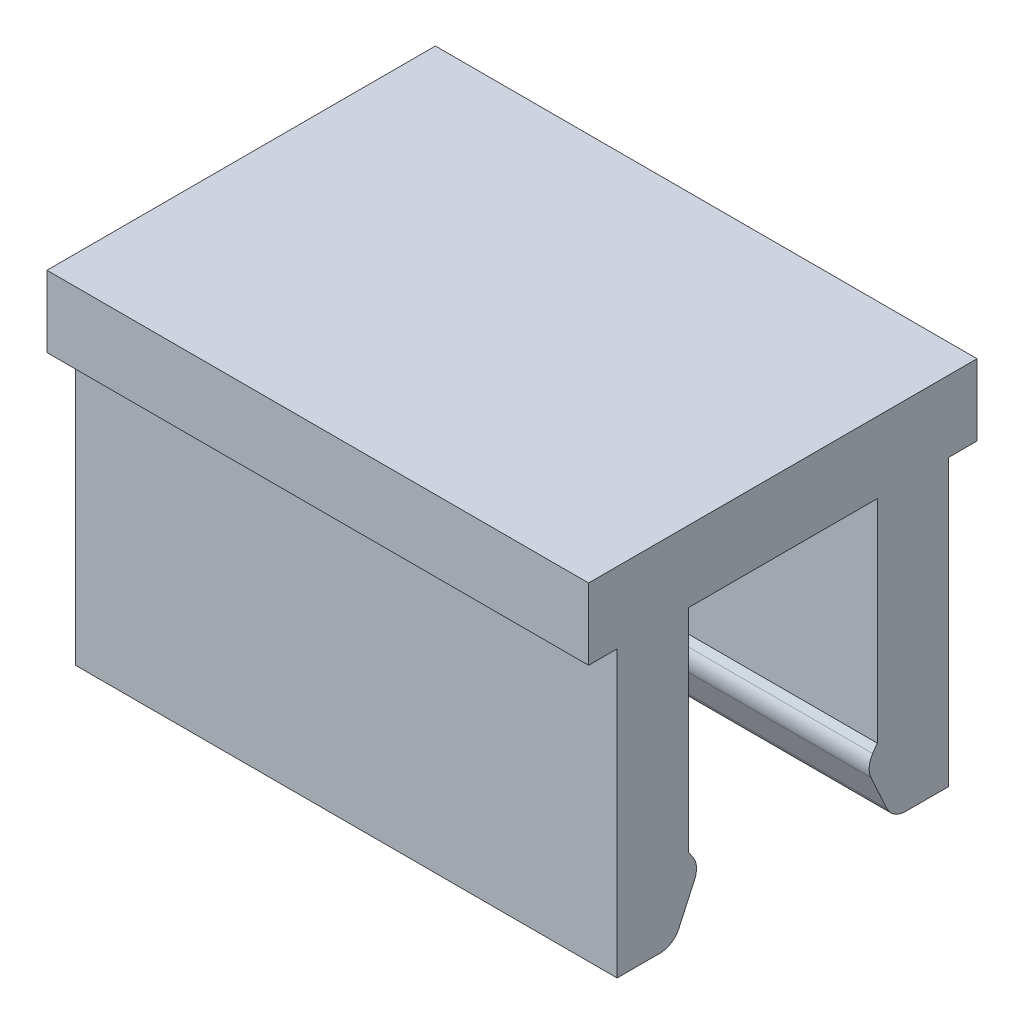
ISO-10303-21;
HEADER;
FILE_DESCRIPTION(('STEP AP214'),'2;1');
FILE_NAME('part.step','',(''),(''),'','','');
FILE_SCHEMA(('AUTOMOTIVE_DESIGN { 1 0 10303 214 1 1 1 1 }'));
ENDSEC;
DATA;
#1=APPLICATION_CONTEXT('core data for automotive mechanical design processes');
#2=APPLICATION_PROTOCOL_DEFINITION('international standard','automotive_design',2000,#1);
#3=PRODUCT_CONTEXT('',#1,'mechanical');
#4=PRODUCT('Part','Part','',(#3));
#5=PRODUCT_RELATED_PRODUCT_CATEGORY('part','',(#4));
#6=PRODUCT_DEFINITION_FORMATION('','',#4);
#7=PRODUCT_DEFINITION_CONTEXT('part definition',#1,'design');
#8=PRODUCT_DEFINITION('design','',#6,#7);
#9=PRODUCT_DEFINITION_SHAPE('','',#8);
#10=(LENGTH_UNIT() NAMED_UNIT(*) SI_UNIT(.MILLI.,.METRE.));
#11=(NAMED_UNIT(*) PLANE_ANGLE_UNIT() SI_UNIT($,.RADIAN.));
#12=(NAMED_UNIT(*) SI_UNIT($,.STERADIAN.) SOLID_ANGLE_UNIT());
#13=UNCERTAINTY_MEASURE_WITH_UNIT(LENGTH_MEASURE(1.E-05),#10,'distance_accuracy_value','');
#14=(GEOMETRIC_REPRESENTATION_CONTEXT(3) GLOBAL_UNCERTAINTY_ASSIGNED_CONTEXT((#13)) GLOBAL_UNIT_ASSIGNED_CONTEXT((#10,
#11,#12)) REPRESENTATION_CONTEXT('',''));
#15=CARTESIAN_POINT('',(0.,0.,0.));
#16=DIRECTION('',(0.,0.,1.));
#17=DIRECTION('',(1.,0.,0.));
#18=AXIS2_PLACEMENT_3D('',#15,#16,#17);
#19=CARTESIAN_POINT('',(-3.8,1.42287130399886,1.50001192514399));
#20=DIRECTION('',(-1.,0.,0.));
#21=DIRECTION('',(0.,1.,0.));
#22=AXIS2_PLACEMENT_3D('',#19,#20,#21);
#23=PLANE('',#22);
#24=DIRECTION('',(0.,1.,0.));
#25=VECTOR('',#24,1.);
#26=CARTESIAN_POINT('',(-3.8,4.65,1.325));
#27=LINE('',#26,#25);
#28=CARTESIAN_POINT('',(-3.8,1.67931591606146,1.325));
#29=VERTEX_POINT('',#28);
#30=CARTESIAN_POINT('',(-3.8,4.65,1.325));
#31=VERTEX_POINT('',#30);
#32=EDGE_CURVE('E297',#29,#31,#27,.T.);
#33=ORIENTED_EDGE('',*,*,#32,.F.);
#34=DIRECTION('',(0.,0.827029873452824,0.5621579746091));
#35=VECTOR('',#34,1.);
#36=CARTESIAN_POINT('',(-3.8,1.58528013365411,1.26108094861411));
#37=LINE('',#36,#35);
#38=CARTESIAN_POINT('',(-3.8,1.58528013365411,1.26108094861411));
#39=VERTEX_POINT('',#38);
#40=EDGE_CURVE('E27',#39,#29,#37,.T.);
#41=ORIENTED_EDGE('',*,*,#40,.F.);
#42=CARTESIAN_POINT('',(-3.8,1.42287130399886,1.50001192514399));
#43=DIRECTION('',(1.,0.,0.));
#44=DIRECTION('',(0.,0.,1.));
#45=AXIS2_PLACEMENT_3D('',#42,#43,#44);
#46=CIRCLE('',#45,0.288902474021096);
#47=CARTESIAN_POINT('',(-3.8,1.3026922137122,1.23729225371952));
#48=VERTEX_POINT('',#47);
#49=EDGE_CURVE('E276',#48,#39,#46,.T.);
#50=ORIENTED_EDGE('',*,*,#49,.F.);
#51=DIRECTION('',(0.,0.909371483628371,-0.415984981415838));
#52=VECTOR('',#51,1.);
#53=CARTESIAN_POINT('',(-3.8,0.818723383734443,1.45868006757625));
#54=LINE('',#53,#52);
#55=CARTESIAN_POINT('',(-3.8,0.818723383734443,1.45868006757625));
#56=VERTEX_POINT('',#55);
#57=EDGE_CURVE('E330',#56,#48,#54,.T.);
#58=ORIENTED_EDGE('',*,*,#57,.F.);
#59=CARTESIAN_POINT('',(-3.8,0.938902474021097,1.72139973900072));
#60=DIRECTION('',(1.,0.,0.));
#61=DIRECTION('',(0.,0.,1.));
#62=AXIS2_PLACEMENT_3D('',#59,#60,#61);
#63=CIRCLE('',#62,0.288902474021096);
#64=CARTESIAN_POINT('',(-3.8,0.65,1.72139973900072));
#65=VERTEX_POINT('',#64);
#66=EDGE_CURVE('E241',#65,#56,#63,.T.);
#67=ORIENTED_EDGE('',*,*,#66,.F.);
#68=DIRECTION('',(0.,0.,-1.));
#69=VECTOR('',#68,1.);
#70=CARTESIAN_POINT('',(-3.8,0.65,1.72139973900072));
#71=LINE('',#70,#69);
#72=CARTESIAN_POINT('',(-3.8,0.65,2.325));
#73=VERTEX_POINT('',#72);
#74=EDGE_CURVE('E237',#73,#65,#71,.T.);
#75=ORIENTED_EDGE('',*,*,#74,.F.);
#76=DIRECTION('',(0.,-1.,0.));
#77=VECTOR('',#76,1.);
#78=CARTESIAN_POINT('',(-3.8,0.65,2.325));
#79=LINE('',#78,#77);
#80=CARTESIAN_POINT('',(-3.8,4.65,2.325));
#81=VERTEX_POINT('',#80);
#82=EDGE_CURVE('E87',#81,#73,#79,.T.);
#83=ORIENTED_EDGE('',*,*,#82,.F.);
#84=DIRECTION('',(0.,0.,-1.));
#85=VECTOR('',#84,1.);
#86=CARTESIAN_POINT('',(-3.8,4.65,2.325));
#87=LINE('',#86,#85);
#88=CARTESIAN_POINT('',(-3.8,4.65,2.725));
#89=VERTEX_POINT('',#88);
#90=EDGE_CURVE('E344',#89,#81,#87,.T.);
#91=ORIENTED_EDGE('',*,*,#90,.F.);
#92=DIRECTION('',(0.,-1.,0.));
#93=VECTOR('',#92,1.);
#94=CARTESIAN_POINT('',(-3.8,4.65,2.725));
#95=LINE('',#94,#93);
#96=CARTESIAN_POINT('',(-3.8,5.65,2.725));
#97=VERTEX_POINT('',#96);
#98=EDGE_CURVE('E308',#97,#89,#95,.T.);
#99=ORIENTED_EDGE('',*,*,#98,.F.);
#100=DIRECTION('',(0.,0.,1.));
#101=VECTOR('',#100,1.);
#102=CARTESIAN_POINT('',(-3.8,5.65,2.725));
#103=LINE('',#102,#101);
#104=CARTESIAN_POINT('',(-3.8,5.65,-2.725));
#105=VERTEX_POINT('',#104);
#106=EDGE_CURVE('E402',#105,#97,#103,.T.);
#107=ORIENTED_EDGE('',*,*,#106,.F.);
#108=DIRECTION('',(0.,1.,0.));
#109=VECTOR('',#108,1.);
#110=CARTESIAN_POINT('',(-3.8,4.65,-2.725));
#111=LINE('',#110,#109);
#112=CARTESIAN_POINT('',(-3.8,4.65,-2.725));
#113=VERTEX_POINT('',#112);
#114=EDGE_CURVE('E207',#113,#105,#111,.T.);
#115=ORIENTED_EDGE('',*,*,#114,.F.);
#116=DIRECTION('',(0.,0.,-1.));
#117=VECTOR('',#116,1.);
#118=CARTESIAN_POINT('',(-3.8,4.65,-2.325));
#119=LINE('',#118,#117);
#120=CARTESIAN_POINT('',(-3.8,4.65,-2.325));
#121=VERTEX_POINT('',#120);
#122=EDGE_CURVE('E292',#121,#113,#119,.T.);
#123=ORIENTED_EDGE('',*,*,#122,.F.);
#124=DIRECTION('',(0.,1.,0.));
#125=VECTOR('',#124,1.);
#126=CARTESIAN_POINT('',(-3.8,0.65,-2.325));
#127=LINE('',#126,#125);
#128=CARTESIAN_POINT('',(-3.8,0.65,-2.325));
#129=VERTEX_POINT('',#128);
#130=EDGE_CURVE('E281',#129,#121,#127,.T.);
#131=ORIENTED_EDGE('',*,*,#130,.F.);
#132=DIRECTION('',(0.,0.,-1.));
#133=VECTOR('',#132,1.);
#134=CARTESIAN_POINT('',(-3.8,0.65,-1.72139973900072));
#135=LINE('',#134,#133);
#136=CARTESIAN_POINT('',(-3.8,0.65,-1.72139973900072));
#137=VERTEX_POINT('',#136);
#138=EDGE_CURVE('E299',#137,#129,#135,.T.);
#139=ORIENTED_EDGE('',*,*,#138,.F.);
#140=CARTESIAN_POINT('',(-3.8,0.938902474021097,-1.72139973900072));
#141=DIRECTION('',(1.,0.,0.));
#142=DIRECTION('',(0.,0.,-1.));
#143=AXIS2_PLACEMENT_3D('',#140,#141,#142);
#144=CIRCLE('',#143,0.288902474021096);
#145=CARTESIAN_POINT('',(-3.8,0.818723383734443,-1.45868006757625));
#146=VERTEX_POINT('',#145);
#147=EDGE_CURVE('E368',#146,#137,#144,.T.);
#148=ORIENTED_EDGE('',*,*,#147,.F.);
#149=DIRECTION('',(0.,-0.909371483628371,-0.415984981415838));
#150=VECTOR('',#149,1.);
#151=CARTESIAN_POINT('',(-3.8,0.818723383734443,-1.45868006757625));
#152=LINE('',#151,#150);
#153=CARTESIAN_POINT('',(-3.8,1.3026922137122,-1.23729225371951));
#154=VERTEX_POINT('',#153);
#155=EDGE_CURVE('E335',#154,#146,#152,.T.);
#156=ORIENTED_EDGE('',*,*,#155,.F.);
#157=CARTESIAN_POINT('',(-3.8,1.42287130399886,-1.50001192514399));
#158=DIRECTION('',(1.,0.,0.));
#159=DIRECTION('',(0.,0.,-1.));
#160=AXIS2_PLACEMENT_3D('',#157,#158,#159);
#161=CIRCLE('',#160,0.288902474021096);
#162=CARTESIAN_POINT('',(-3.8,1.58528013365411,-1.26108094861411));
#163=VERTEX_POINT('',#162);
#164=EDGE_CURVE('E298',#163,#154,#161,.T.);
#165=ORIENTED_EDGE('',*,*,#164,.F.);
#166=DIRECTION('',(0.,-0.827029873452824,0.5621579746091));
#167=VECTOR('',#166,1.);
#168=CARTESIAN_POINT('',(-3.8,1.58528013365411,-1.26108094861411));
#169=LINE('',#168,#167);
#170=CARTESIAN_POINT('',(-3.8,1.67931591606146,-1.325));
#171=VERTEX_POINT('',#170);
#172=EDGE_CURVE('E130',#171,#163,#169,.T.);
#173=ORIENTED_EDGE('',*,*,#172,.F.);
#174=DIRECTION('',(0.,-1.,0.));
#175=VECTOR('',#174,1.);
#176=CARTESIAN_POINT('',(-3.8,4.65,-1.325));
#177=LINE('',#176,#175);
#178=CARTESIAN_POINT('',(-3.8,4.65,-1.325));
#179=VERTEX_POINT('',#178);
#180=EDGE_CURVE('E424',#179,#171,#177,.T.);
#181=ORIENTED_EDGE('',*,*,#180,.F.);
#182=DIRECTION('',(0.,0.,-1.));
#183=VECTOR('',#182,1.);
#184=CARTESIAN_POINT('',(-3.8,4.65,-1.325));
#185=LINE('',#184,#183);
#186=EDGE_CURVE('E287',#31,#179,#185,.T.);
#187=ORIENTED_EDGE('',*,*,#186,.F.);
#188=EDGE_LOOP('',(#33,#41,#50,#58,#67,#75,#83,#91,#99,#107,#115,#123,#131,#139,#148,#156,#165,
#173,#181,#187));
#189=FACE_BOUND('',#188,.T.);
#190=ADVANCED_FACE('F16',(#189),#23,.T.);
#191=CARTESIAN_POINT('',(3.8,1.42287130399886,1.50001192514399));
#192=DIRECTION('',(-1.,0.,0.));
#193=DIRECTION('',(0.,1.,0.));
#194=AXIS2_PLACEMENT_3D('',#191,#192,#193);
#195=PLANE('',#194);
#196=DIRECTION('',(0.,1.,0.));
#197=VECTOR('',#196,1.);
#198=CARTESIAN_POINT('',(3.8,4.65,1.325));
#199=LINE('',#198,#197);
#200=CARTESIAN_POINT('',(3.8,1.67931591606146,1.325));
#201=VERTEX_POINT('',#200);
#202=CARTESIAN_POINT('',(3.8,4.65,1.325));
#203=VERTEX_POINT('',#202);
#204=EDGE_CURVE('E288',#201,#203,#199,.T.);
#205=ORIENTED_EDGE('',*,*,#204,.T.);
#206=DIRECTION('',(0.,0.,-1.));
#207=VECTOR('',#206,1.);
#208=CARTESIAN_POINT('',(3.8,4.65,-1.325));
#209=LINE('',#208,#207);
#210=CARTESIAN_POINT('',(3.8,4.65,-1.325));
#211=VERTEX_POINT('',#210);
#212=EDGE_CURVE('E421',#203,#211,#209,.T.);
#213=ORIENTED_EDGE('',*,*,#212,.T.);
#214=DIRECTION('',(0.,-1.,0.));
#215=VECTOR('',#214,1.);
#216=CARTESIAN_POINT('',(3.8,4.65,-1.325));
#217=LINE('',#216,#215);
#218=CARTESIAN_POINT('',(3.8,1.67931591606146,-1.325));
#219=VERTEX_POINT('',#218);
#220=EDGE_CURVE('E147',#211,#219,#217,.T.);
#221=ORIENTED_EDGE('',*,*,#220,.T.);
#222=DIRECTION('',(0.,-0.827029873452824,0.5621579746091));
#223=VECTOR('',#222,1.);
#224=CARTESIAN_POINT('',(3.8,1.58528013365411,-1.26108094861411));
#225=LINE('',#224,#223);
#226=CARTESIAN_POINT('',(3.8,1.58528013365411,-1.26108094861411));
#227=VERTEX_POINT('',#226);
#228=EDGE_CURVE('E340',#219,#227,#225,.T.);
#229=ORIENTED_EDGE('',*,*,#228,.T.);
#230=CARTESIAN_POINT('',(3.8,1.42287130399886,-1.50001192514399));
#231=DIRECTION('',(1.,0.,0.));
#232=DIRECTION('',(0.,0.,-1.));
#233=AXIS2_PLACEMENT_3D('',#230,#231,#232);
#234=CIRCLE('',#233,0.288902474021096);
#235=CARTESIAN_POINT('',(3.8,1.3026922137122,-1.23729225371952));
#236=VERTEX_POINT('',#235);
#237=EDGE_CURVE('E373',#227,#236,#234,.T.);
#238=ORIENTED_EDGE('',*,*,#237,.T.);
#239=DIRECTION('',(0.,-0.909371483628371,-0.415984981415838));
#240=VECTOR('',#239,1.);
#241=CARTESIAN_POINT('',(3.8,0.818723383734443,-1.45868006757625));
#242=LINE('',#241,#240);
#243=CARTESIAN_POINT('',(3.8,0.818723383734443,-1.45868006757625));
#244=VERTEX_POINT('',#243);
#245=EDGE_CURVE('E358',#236,#244,#242,.T.);
#246=ORIENTED_EDGE('',*,*,#245,.T.);
#247=CARTESIAN_POINT('',(3.8,0.938902474021097,-1.72139973900072));
#248=DIRECTION('',(1.,0.,0.));
#249=DIRECTION('',(0.,0.,-1.));
#250=AXIS2_PLACEMENT_3D('',#247,#248,#249);
#251=CIRCLE('',#250,0.288902474021096);
#252=CARTESIAN_POINT('',(3.8,0.65,-1.72139973900072));
#253=VERTEX_POINT('',#252);
#254=EDGE_CURVE('E303',#244,#253,#251,.T.);
#255=ORIENTED_EDGE('',*,*,#254,.T.);
#256=DIRECTION('',(0.,0.,-1.));
#257=VECTOR('',#256,1.);
#258=CARTESIAN_POINT('',(3.8,0.65,-1.72139973900072));
#259=LINE('',#258,#257);
#260=CARTESIAN_POINT('',(3.8,0.65,-2.325));
#261=VERTEX_POINT('',#260);
#262=EDGE_CURVE('E277',#253,#261,#259,.T.);
#263=ORIENTED_EDGE('',*,*,#262,.T.);
#264=DIRECTION('',(0.,1.,0.));
#265=VECTOR('',#264,1.);
#266=CARTESIAN_POINT('',(3.8,0.65,-2.325));
#267=LINE('',#266,#265);
#268=CARTESIAN_POINT('',(3.8,4.65,-2.325));
#269=VERTEX_POINT('',#268);
#270=EDGE_CURVE('E385',#261,#269,#267,.T.);
#271=ORIENTED_EDGE('',*,*,#270,.T.);
#272=DIRECTION('',(0.,0.,-1.));
#273=VECTOR('',#272,1.);
#274=CARTESIAN_POINT('',(3.8,4.65,-2.325));
#275=LINE('',#274,#273);
#276=CARTESIAN_POINT('',(3.8,4.65,-2.725));
#277=VERTEX_POINT('',#276);
#278=EDGE_CURVE('E218',#269,#277,#275,.T.);
#279=ORIENTED_EDGE('',*,*,#278,.T.);
#280=DIRECTION('',(0.,1.,0.));
#281=VECTOR('',#280,1.);
#282=CARTESIAN_POINT('',(3.8,4.65,-2.725));
#283=LINE('',#282,#281);
#284=CARTESIAN_POINT('',(3.8,5.65,-2.725));
#285=VERTEX_POINT('',#284);
#286=EDGE_CURVE('E201',#277,#285,#283,.T.);
#287=ORIENTED_EDGE('',*,*,#286,.T.);
#288=DIRECTION('',(0.,0.,1.));
#289=VECTOR('',#288,1.);
#290=CARTESIAN_POINT('',(3.8,5.65,2.725));
#291=LINE('',#290,#289);
#292=CARTESIAN_POINT('',(3.8,5.65,2.725));
#293=VERTEX_POINT('',#292);
#294=EDGE_CURVE('E386',#285,#293,#291,.T.);
#295=ORIENTED_EDGE('',*,*,#294,.T.);
#296=DIRECTION('',(0.,-1.,0.));
#297=VECTOR('',#296,1.);
#298=CARTESIAN_POINT('',(3.8,4.65,2.725));
#299=LINE('',#298,#297);
#300=CARTESIAN_POINT('',(3.8,4.65,2.725));
#301=VERTEX_POINT('',#300);
#302=EDGE_CURVE('E307',#293,#301,#299,.T.);
#303=ORIENTED_EDGE('',*,*,#302,.T.);
#304=DIRECTION('',(0.,0.,-1.));
#305=VECTOR('',#304,1.);
#306=CARTESIAN_POINT('',(3.8,4.65,2.325));
#307=LINE('',#306,#305);
#308=CARTESIAN_POINT('',(3.8,4.65,2.325));
#309=VERTEX_POINT('',#308);
#310=EDGE_CURVE('E105',#301,#309,#307,.T.);
#311=ORIENTED_EDGE('',*,*,#310,.T.);
#312=DIRECTION('',(0.,-1.,0.));
#313=VECTOR('',#312,1.);
#314=CARTESIAN_POINT('',(3.8,0.65,2.325));
#315=LINE('',#314,#313);
#316=CARTESIAN_POINT('',(3.8,0.65,2.325));
#317=VERTEX_POINT('',#316);
#318=EDGE_CURVE('E247',#309,#317,#315,.T.);
#319=ORIENTED_EDGE('',*,*,#318,.T.);
#320=DIRECTION('',(0.,0.,-1.));
#321=VECTOR('',#320,1.);
#322=CARTESIAN_POINT('',(3.8,0.65,1.72139973900072));
#323=LINE('',#322,#321);
#324=CARTESIAN_POINT('',(3.8,0.65,1.72139973900072));
#325=VERTEX_POINT('',#324);
#326=EDGE_CURVE('E252',#317,#325,#323,.T.);
#327=ORIENTED_EDGE('',*,*,#326,.T.);
#328=CARTESIAN_POINT('',(3.8,0.938902474021097,1.72139973900072));
#329=DIRECTION('',(1.,0.,0.));
#330=DIRECTION('',(0.,0.,1.));
#331=AXIS2_PLACEMENT_3D('',#328,#329,#330);
#332=CIRCLE('',#331,0.288902474021096);
#333=CARTESIAN_POINT('',(3.8,0.818723383734443,1.45868006757625));
#334=VERTEX_POINT('',#333);
#335=EDGE_CURVE('E326',#325,#334,#332,.T.);
#336=ORIENTED_EDGE('',*,*,#335,.T.);
#337=DIRECTION('',(0.,0.909371483628371,-0.415984981415838));
#338=VECTOR('',#337,1.);
#339=CARTESIAN_POINT('',(3.8,0.818723383734443,1.45868006757625));
#340=LINE('',#339,#338);
#341=CARTESIAN_POINT('',(3.8,1.3026922137122,1.23729225371951));
#342=VERTEX_POINT('',#341);
#343=EDGE_CURVE('E369',#334,#342,#340,.T.);
#344=ORIENTED_EDGE('',*,*,#343,.T.);
#345=CARTESIAN_POINT('',(3.8,1.42287130399886,1.50001192514399));
#346=DIRECTION('',(1.,0.,0.));
#347=DIRECTION('',(0.,0.,1.));
#348=AXIS2_PLACEMENT_3D('',#345,#346,#347);
#349=CIRCLE('',#348,0.288902474021096);
#350=CARTESIAN_POINT('',(3.8,1.58528013365411,1.26108094861411));
#351=VERTEX_POINT('',#350);
#352=EDGE_CURVE('E272',#342,#351,#349,.T.);
#353=ORIENTED_EDGE('',*,*,#352,.T.);
#354=DIRECTION('',(0.,0.827029873452824,0.5621579746091));
#355=VECTOR('',#354,1.);
#356=CARTESIAN_POINT('',(3.8,1.58528013365411,1.26108094861411));
#357=LINE('',#356,#355);
#358=EDGE_CURVE('E11',#351,#201,#357,.T.);
#359=ORIENTED_EDGE('',*,*,#358,.T.);
#360=EDGE_LOOP('',(#205,#213,#221,#229,#238,#246,#255,#263,#271,#279,#287,#295,#303,#311,#319,
#327,#336,#344,#353,#359));
#361=FACE_BOUND('',#360,.T.);
#362=ADVANCED_FACE('F470',(#361),#195,.F.);
#363=CARTESIAN_POINT('',(3.8,1.58528013365411,1.26108094861411));
#364=DIRECTION('',(0.,-0.5621579746091,0.827029873452824));
#365=DIRECTION('',(-1.,0.,0.));
#366=AXIS2_PLACEMENT_3D('',#363,#364,#365);
#367=PLANE('',#366);
#368=ORIENTED_EDGE('',*,*,#40,.T.);
#369=DIRECTION('',(-1.,0.,0.));
#370=VECTOR('',#369,1.);
#371=CARTESIAN_POINT('',(3.8,1.67931591606146,1.325));
#372=LINE('',#371,#370);
#373=EDGE_CURVE('E283',#201,#29,#372,.T.);
#374=ORIENTED_EDGE('',*,*,#373,.F.);
#375=ORIENTED_EDGE('',*,*,#358,.F.);
#376=DIRECTION('',(-1.,0.,0.));
#377=VECTOR('',#376,1.);
#378=CARTESIAN_POINT('',(3.8,1.58528013365411,1.26108094861411));
#379=LINE('',#378,#377);
#380=EDGE_CURVE('E273',#351,#39,#379,.T.);
#381=ORIENTED_EDGE('',*,*,#380,.T.);
#382=EDGE_LOOP('',(#368,#374,#375,#381));
#383=FACE_BOUND('',#382,.T.);
#384=ADVANCED_FACE('F468',(#383),#367,.F.);
#385=CARTESIAN_POINT('',(3.8,1.42287130399886,1.50001192514399));
#386=DIRECTION('',(-1.,0.,0.));
#387=DIRECTION('',(0.,0.,1.));
#388=AXIS2_PLACEMENT_3D('',#385,#386,#387);
#389=CYLINDRICAL_SURFACE('',#388,0.288902474021096);
#390=ORIENTED_EDGE('',*,*,#49,.T.);
#391=ORIENTED_EDGE('',*,*,#380,.F.);
#392=ORIENTED_EDGE('',*,*,#352,.F.);
#393=DIRECTION('',(-1.,0.,0.));
#394=VECTOR('',#393,1.);
#395=CARTESIAN_POINT('',(3.8,1.3026922137122,1.23729225371951));
#396=LINE('',#395,#394);
#397=EDGE_CURVE('E350',#342,#48,#396,.T.);
#398=ORIENTED_EDGE('',*,*,#397,.T.);
#399=EDGE_LOOP('',(#390,#391,#392,#398));
#400=FACE_BOUND('',#399,.T.);
#401=ADVANCED_FACE('F463',(#400),#389,.T.);
#402=CARTESIAN_POINT('',(3.8,0.818723383734443,1.45868006757625));
#403=DIRECTION('',(0.,0.415984981415838,0.909371483628371));
#404=DIRECTION('',(1.,0.,0.));
#405=AXIS2_PLACEMENT_3D('',#402,#403,#404);
#406=PLANE('',#405);
#407=ORIENTED_EDGE('',*,*,#57,.T.);
#408=ORIENTED_EDGE('',*,*,#397,.F.);
#409=ORIENTED_EDGE('',*,*,#343,.F.);
#410=DIRECTION('',(-1.,0.,0.));
#411=VECTOR('',#410,1.);
#412=CARTESIAN_POINT('',(3.8,0.818723383734443,1.45868006757625));
#413=LINE('',#412,#411);
#414=EDGE_CURVE('E325',#334,#56,#413,.T.);
#415=ORIENTED_EDGE('',*,*,#414,.T.);
#416=EDGE_LOOP('',(#407,#408,#409,#415));
#417=FACE_BOUND('',#416,.T.);
#418=ADVANCED_FACE('F466',(#417),#406,.F.);
#419=CARTESIAN_POINT('',(3.8,0.938902474021097,1.72139973900072));
#420=DIRECTION('',(-1.,0.,0.));
#421=DIRECTION('',(0.,0.,1.));
#422=AXIS2_PLACEMENT_3D('',#419,#420,#421);
#423=CYLINDRICAL_SURFACE('',#422,0.288902474021096);
#424=ORIENTED_EDGE('',*,*,#66,.T.);
#425=ORIENTED_EDGE('',*,*,#414,.F.);
#426=ORIENTED_EDGE('',*,*,#335,.F.);
#427=DIRECTION('',(-1.,0.,0.));
#428=VECTOR('',#427,1.);
#429=CARTESIAN_POINT('',(3.8,0.65,1.72139973900072));
#430=LINE('',#429,#428);
#431=EDGE_CURVE('E246',#325,#65,#430,.T.);
#432=ORIENTED_EDGE('',*,*,#431,.T.);
#433=EDGE_LOOP('',(#424,#425,#426,#432));
#434=FACE_BOUND('',#433,.T.);
#435=ADVANCED_FACE('F601',(#434),#423,.T.);
#436=CARTESIAN_POINT('',(3.8,0.65,1.72139973900072));
#437=DIRECTION('',(0.,1.,0.));
#438=DIRECTION('',(1.,0.,0.));
#439=AXIS2_PLACEMENT_3D('',#436,#437,#438);
#440=PLANE('',#439);
#441=ORIENTED_EDGE('',*,*,#74,.T.);
#442=ORIENTED_EDGE('',*,*,#431,.F.);
#443=ORIENTED_EDGE('',*,*,#326,.F.);
#444=DIRECTION('',(-1.,0.,0.));
#445=VECTOR('',#444,1.);
#446=CARTESIAN_POINT('',(3.8,0.65,2.325));
#447=LINE('',#446,#445);
#448=EDGE_CURVE('E20',#317,#73,#447,.T.);
#449=ORIENTED_EDGE('',*,*,#448,.T.);
#450=EDGE_LOOP('',(#441,#442,#443,#449));
#451=FACE_BOUND('',#450,.T.);
#452=ADVANCED_FACE('F250',(#451),#440,.F.);
#453=CARTESIAN_POINT('',(3.8,0.65,2.325));
#454=DIRECTION('',(0.,0.,-1.));
#455=DIRECTION('',(-1.,0.,0.));
#456=AXIS2_PLACEMENT_3D('',#453,#454,#455);
#457=PLANE('',#456);
#458=ORIENTED_EDGE('',*,*,#82,.T.);
#459=ORIENTED_EDGE('',*,*,#448,.F.);
#460=ORIENTED_EDGE('',*,*,#318,.F.);
#461=DIRECTION('',(-1.,0.,0.));
#462=VECTOR('',#461,1.);
#463=CARTESIAN_POINT('',(3.8,4.65,2.325));
#464=LINE('',#463,#462);
#465=EDGE_CURVE('E257',#309,#81,#464,.T.);
#466=ORIENTED_EDGE('',*,*,#465,.T.);
#467=EDGE_LOOP('',(#458,#459,#460,#466));
#468=FACE_BOUND('',#467,.T.);
#469=ADVANCED_FACE('F256',(#468),#457,.F.);
#470=CARTESIAN_POINT('',(3.8,4.65,2.325));
#471=DIRECTION('',(0.,1.,0.));
#472=DIRECTION('',(1.,0.,0.));
#473=AXIS2_PLACEMENT_3D('',#470,#471,#472);
#474=PLANE('',#473);
#475=ORIENTED_EDGE('',*,*,#90,.T.);
#476=ORIENTED_EDGE('',*,*,#465,.F.);
#477=ORIENTED_EDGE('',*,*,#310,.F.);
#478=DIRECTION('',(-1.,0.,0.));
#479=VECTOR('',#478,1.);
#480=CARTESIAN_POINT('',(3.8,4.65,2.725));
#481=LINE('',#480,#479);
#482=EDGE_CURVE('E304',#301,#89,#481,.T.);
#483=ORIENTED_EDGE('',*,*,#482,.T.);
#484=EDGE_LOOP('',(#475,#476,#477,#483));
#485=FACE_BOUND('',#484,.T.);
#486=ADVANCED_FACE('F661',(#485),#474,.F.);
#487=CARTESIAN_POINT('',(3.8,4.65,2.725));
#488=DIRECTION('',(0.,0.,-1.));
#489=DIRECTION('',(-1.,0.,0.));
#490=AXIS2_PLACEMENT_3D('',#487,#488,#489);
#491=PLANE('',#490);
#492=ORIENTED_EDGE('',*,*,#98,.T.);
#493=ORIENTED_EDGE('',*,*,#482,.F.);
#494=ORIENTED_EDGE('',*,*,#302,.F.);
#495=DIRECTION('',(-1.,0.,0.));
#496=VECTOR('',#495,1.);
#497=CARTESIAN_POINT('',(3.8,5.65,2.725));
#498=LINE('',#497,#496);
#499=EDGE_CURVE('E390',#293,#97,#498,.T.);
#500=ORIENTED_EDGE('',*,*,#499,.T.);
#501=EDGE_LOOP('',(#492,#493,#494,#500));
#502=FACE_BOUND('',#501,.T.);
#503=ADVANCED_FACE('F497',(#502),#491,.F.);
#504=CARTESIAN_POINT('',(3.8,5.65,2.725));
#505=DIRECTION('',(0.,-1.,0.));
#506=DIRECTION('',(0.,0.,-1.));
#507=AXIS2_PLACEMENT_3D('',#504,#505,#506);
#508=PLANE('',#507);
#509=ORIENTED_EDGE('',*,*,#106,.T.);
#510=ORIENTED_EDGE('',*,*,#499,.F.);
#511=ORIENTED_EDGE('',*,*,#294,.F.);
#512=DIRECTION('',(-1.,0.,0.));
#513=VECTOR('',#512,1.);
#514=CARTESIAN_POINT('',(3.8,5.65,-2.725));
#515=LINE('',#514,#513);
#516=EDGE_CURVE('E319',#285,#105,#515,.T.);
#517=ORIENTED_EDGE('',*,*,#516,.T.);
#518=EDGE_LOOP('',(#509,#510,#511,#517));
#519=FACE_BOUND('',#518,.T.);
#520=ADVANCED_FACE('F495',(#519),#508,.F.);
#521=CARTESIAN_POINT('',(3.8,4.65,-2.725));
#522=DIRECTION('',(0.,0.,1.));
#523=DIRECTION('',(1.,0.,0.));
#524=AXIS2_PLACEMENT_3D('',#521,#522,#523);
#525=PLANE('',#524);
#526=ORIENTED_EDGE('',*,*,#114,.T.);
#527=ORIENTED_EDGE('',*,*,#516,.F.);
#528=ORIENTED_EDGE('',*,*,#286,.F.);
#529=DIRECTION('',(-1.,0.,0.));
#530=VECTOR('',#529,1.);
#531=CARTESIAN_POINT('',(3.8,4.65,-2.725));
#532=LINE('',#531,#530);
#533=EDGE_CURVE('E289',#277,#113,#532,.T.);
#534=ORIENTED_EDGE('',*,*,#533,.T.);
#535=EDGE_LOOP('',(#526,#527,#528,#534));
#536=FACE_BOUND('',#535,.T.);
#537=ADVANCED_FACE('F486',(#536),#525,.F.);
#538=CARTESIAN_POINT('',(3.8,4.65,-2.325));
#539=DIRECTION('',(0.,1.,0.));
#540=DIRECTION('',(1.,0.,0.));
#541=AXIS2_PLACEMENT_3D('',#538,#539,#540);
#542=PLANE('',#541);
#543=ORIENTED_EDGE('',*,*,#122,.T.);
#544=ORIENTED_EDGE('',*,*,#533,.F.);
#545=ORIENTED_EDGE('',*,*,#278,.F.);
#546=DIRECTION('',(-1.,0.,0.));
#547=VECTOR('',#546,1.);
#548=CARTESIAN_POINT('',(3.8,4.65,-2.325));
#549=LINE('',#548,#547);
#550=EDGE_CURVE('E420',#269,#121,#549,.T.);
#551=ORIENTED_EDGE('',*,*,#550,.T.);
#552=EDGE_LOOP('',(#543,#544,#545,#551));
#553=FACE_BOUND('',#552,.T.);
#554=ADVANCED_FACE('F502',(#553),#542,.F.);
#555=CARTESIAN_POINT('',(3.8,0.65,-2.325));
#556=DIRECTION('',(0.,0.,1.));
#557=DIRECTION('',(1.,0.,0.));
#558=AXIS2_PLACEMENT_3D('',#555,#556,#557);
#559=PLANE('',#558);
#560=ORIENTED_EDGE('',*,*,#130,.T.);
#561=ORIENTED_EDGE('',*,*,#550,.F.);
#562=ORIENTED_EDGE('',*,*,#270,.F.);
#563=DIRECTION('',(-1.,0.,0.));
#564=VECTOR('',#563,1.);
#565=CARTESIAN_POINT('',(3.8,0.65,-2.325));
#566=LINE('',#565,#564);
#567=EDGE_CURVE('E282',#261,#129,#566,.T.);
#568=ORIENTED_EDGE('',*,*,#567,.T.);
#569=EDGE_LOOP('',(#560,#561,#562,#568));
#570=FACE_BOUND('',#569,.T.);
#571=ADVANCED_FACE('F499',(#570),#559,.F.);
#572=CARTESIAN_POINT('',(3.8,0.65,-1.72139973900072));
#573=DIRECTION('',(0.,1.,0.));
#574=DIRECTION('',(1.,0.,0.));
#575=AXIS2_PLACEMENT_3D('',#572,#573,#574);
#576=PLANE('',#575);
#577=ORIENTED_EDGE('',*,*,#138,.T.);
#578=ORIENTED_EDGE('',*,*,#567,.F.);
#579=ORIENTED_EDGE('',*,*,#262,.F.);
#580=DIRECTION('',(-1.,0.,0.));
#581=VECTOR('',#580,1.);
#582=CARTESIAN_POINT('',(3.8,0.65,-1.72139973900072));
#583=LINE('',#582,#581);
#584=EDGE_CURVE('E364',#253,#137,#583,.T.);
#585=ORIENTED_EDGE('',*,*,#584,.T.);
#586=EDGE_LOOP('',(#577,#578,#579,#585));
#587=FACE_BOUND('',#586,.T.);
#588=ADVANCED_FACE('F501',(#587),#576,.F.);
#589=CARTESIAN_POINT('',(3.8,0.938902474021097,-1.72139973900072));
#590=DIRECTION('',(-1.,0.,0.));
#591=DIRECTION('',(0.,0.,1.));
#592=AXIS2_PLACEMENT_3D('',#589,#590,#591);
#593=CYLINDRICAL_SURFACE('',#592,0.288902474021096);
#594=ORIENTED_EDGE('',*,*,#147,.T.);
#595=ORIENTED_EDGE('',*,*,#584,.F.);
#596=ORIENTED_EDGE('',*,*,#254,.F.);
#597=DIRECTION('',(-1.,0.,0.));
#598=VECTOR('',#597,1.);
#599=CARTESIAN_POINT('',(3.8,0.818723383734443,-1.45868006757625));
#600=LINE('',#599,#598);
#601=EDGE_CURVE('E339',#244,#146,#600,.T.);
#602=ORIENTED_EDGE('',*,*,#601,.T.);
#603=EDGE_LOOP('',(#594,#595,#596,#602));
#604=FACE_BOUND('',#603,.T.);
#605=ADVANCED_FACE('F493',(#604),#593,.T.);
#606=CARTESIAN_POINT('',(3.8,0.818723383734443,-1.45868006757625));
#607=DIRECTION('',(0.,0.415984981415838,-0.909371483628371));
#608=DIRECTION('',(-1.,0.,0.));
#609=AXIS2_PLACEMENT_3D('',#606,#607,#608);
#610=PLANE('',#609);
#611=ORIENTED_EDGE('',*,*,#155,.T.);
#612=ORIENTED_EDGE('',*,*,#601,.F.);
#613=ORIENTED_EDGE('',*,*,#245,.F.);
#614=DIRECTION('',(-1.,0.,0.));
#615=VECTOR('',#614,1.);
#616=CARTESIAN_POINT('',(3.8,1.3026922137122,-1.23729225371952));
#617=LINE('',#616,#615);
#618=EDGE_CURVE('E293',#236,#154,#617,.T.);
#619=ORIENTED_EDGE('',*,*,#618,.T.);
#620=EDGE_LOOP('',(#611,#612,#613,#619));
#621=FACE_BOUND('',#620,.T.);
#622=ADVANCED_FACE('F489',(#621),#610,.F.);
#623=CARTESIAN_POINT('',(3.8,1.58528013365411,-1.26108094861411));
#624=DIRECTION('',(0.,-0.5621579746091,-0.827029873452824));
#625=DIRECTION('',(0.,-0.827029873452824,0.5621579746091));
#626=AXIS2_PLACEMENT_3D('',#623,#624,#625);
#627=PLANE('',#626);
#628=ORIENTED_EDGE('',*,*,#172,.T.);
#629=DIRECTION('',(-1.,0.,0.));
#630=VECTOR('',#629,1.);
#631=CARTESIAN_POINT('',(3.8,1.58528013365411,-1.26108094861411));
#632=LINE('',#631,#630);
#633=EDGE_CURVE('E312',#227,#163,#632,.T.);
#634=ORIENTED_EDGE('',*,*,#633,.F.);
#635=ORIENTED_EDGE('',*,*,#228,.F.);
#636=DIRECTION('',(-1.,0.,0.));
#637=VECTOR('',#636,1.);
#638=CARTESIAN_POINT('',(3.8,1.67931591606146,-1.325));
#639=LINE('',#638,#637);
#640=EDGE_CURVE('E269',#219,#171,#639,.T.);
#641=ORIENTED_EDGE('',*,*,#640,.T.);
#642=EDGE_LOOP('',(#628,#634,#635,#641));
#643=FACE_BOUND('',#642,.T.);
#644=ADVANCED_FACE('F492',(#643),#627,.F.);
#645=CARTESIAN_POINT('',(3.8,4.65,-1.325));
#646=DIRECTION('',(0.,0.,-1.));
#647=DIRECTION('',(-1.,0.,0.));
#648=AXIS2_PLACEMENT_3D('',#645,#646,#647);
#649=PLANE('',#648);
#650=ORIENTED_EDGE('',*,*,#180,.T.);
#651=ORIENTED_EDGE('',*,*,#640,.F.);
#652=ORIENTED_EDGE('',*,*,#220,.F.);
#653=DIRECTION('',(-1.,0.,0.));
#654=VECTOR('',#653,1.);
#655=CARTESIAN_POINT('',(3.8,4.65,-1.325));
#656=LINE('',#655,#654);
#657=EDGE_CURVE('E316',#211,#179,#656,.T.);
#658=ORIENTED_EDGE('',*,*,#657,.T.);
#659=EDGE_LOOP('',(#650,#651,#652,#658));
#660=FACE_BOUND('',#659,.T.);
#661=ADVANCED_FACE('F609',(#660),#649,.F.);
#662=CARTESIAN_POINT('',(3.8,4.65,-1.325));
#663=DIRECTION('',(0.,1.,0.));
#664=DIRECTION('',(1.,0.,0.));
#665=AXIS2_PLACEMENT_3D('',#662,#663,#664);
#666=PLANE('',#665);
#667=ORIENTED_EDGE('',*,*,#186,.T.);
#668=ORIENTED_EDGE('',*,*,#657,.F.);
#669=ORIENTED_EDGE('',*,*,#212,.F.);
#670=DIRECTION('',(-1.,0.,0.));
#671=VECTOR('',#670,1.);
#672=CARTESIAN_POINT('',(3.8,4.65,1.325));
#673=LINE('',#672,#671);
#674=EDGE_CURVE('E334',#203,#31,#673,.T.);
#675=ORIENTED_EDGE('',*,*,#674,.T.);
#676=EDGE_LOOP('',(#667,#668,#669,#675));
#677=FACE_BOUND('',#676,.T.);
#678=ADVANCED_FACE('F534',(#677),#666,.F.);
#679=CARTESIAN_POINT('',(3.8,4.65,1.325));
#680=DIRECTION('',(0.,0.,1.));
#681=DIRECTION('',(1.,0.,0.));
#682=AXIS2_PLACEMENT_3D('',#679,#680,#681);
#683=PLANE('',#682);
#684=ORIENTED_EDGE('',*,*,#32,.T.);
#685=ORIENTED_EDGE('',*,*,#674,.F.);
#686=ORIENTED_EDGE('',*,*,#204,.F.);
#687=ORIENTED_EDGE('',*,*,#373,.T.);
#688=EDGE_LOOP('',(#684,#685,#686,#687));
#689=FACE_BOUND('',#688,.T.);
#690=ADVANCED_FACE('F18',(#689),#683,.F.);
#691=CARTESIAN_POINT('',(3.8,1.42287130399886,-1.50001192514399));
#692=DIRECTION('',(-1.,0.,0.));
#693=DIRECTION('',(0.,0.,1.));
#694=AXIS2_PLACEMENT_3D('',#691,#692,#693);
#695=CYLINDRICAL_SURFACE('',#694,0.288902474021096);
#696=ORIENTED_EDGE('',*,*,#237,.F.);
#697=ORIENTED_EDGE('',*,*,#633,.T.);
#698=ORIENTED_EDGE('',*,*,#164,.T.);
#699=ORIENTED_EDGE('',*,*,#618,.F.);
#700=EDGE_LOOP('',(#696,#697,#698,#699));
#701=FACE_BOUND('',#700,.T.);
#702=ADVANCED_FACE('F521',(#701),#695,.T.);
#703=CLOSED_SHELL('',(#190,#362,#384,#401,#418,#435,#452,#469,#486,#503,#520,#537,#554,#571,
#588,#605,#622,#644,#661,#678,#690,#702));
#704=MANIFOLD_SOLID_BREP('B1',#703);
#705=ADVANCED_BREP_SHAPE_REPRESENTATION('',(#18,#704),#14);
#706=SHAPE_DEFINITION_REPRESENTATION(#9,#705);
ENDSEC;
END-ISO-10303-21;
